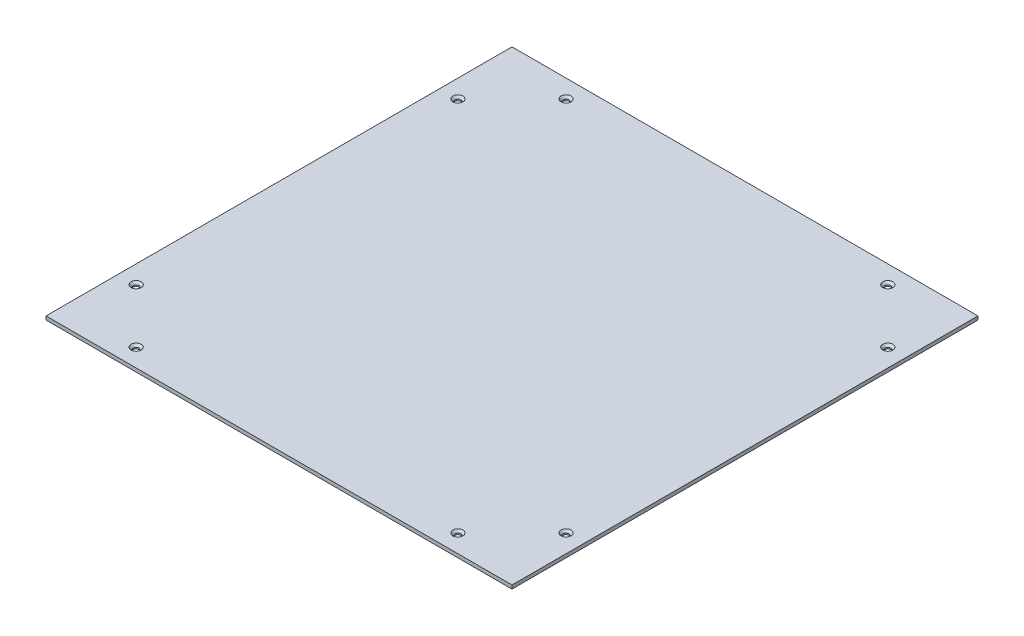
ISO-10303-21;
HEADER;
FILE_DESCRIPTION(('STEP AP214'),'2;1');
FILE_NAME('part.step','',(''),(''),'','','');
FILE_SCHEMA(('AUTOMOTIVE_DESIGN { 1 0 10303 214 1 1 1 1 }'));
ENDSEC;
DATA;
#1=APPLICATION_CONTEXT('core data for automotive mechanical design processes');
#2=APPLICATION_PROTOCOL_DEFINITION('international standard','automotive_design',2000,#1);
#3=PRODUCT_CONTEXT('',#1,'mechanical');
#4=PRODUCT('Part','Part','',(#3));
#5=PRODUCT_RELATED_PRODUCT_CATEGORY('part','',(#4));
#6=PRODUCT_DEFINITION_FORMATION('','',#4);
#7=PRODUCT_DEFINITION_CONTEXT('part definition',#1,'design');
#8=PRODUCT_DEFINITION('design','',#6,#7);
#9=PRODUCT_DEFINITION_SHAPE('','',#8);
#10=(LENGTH_UNIT() NAMED_UNIT(*) SI_UNIT(.MILLI.,.METRE.));
#11=(NAMED_UNIT(*) PLANE_ANGLE_UNIT() SI_UNIT($,.RADIAN.));
#12=(NAMED_UNIT(*) SI_UNIT($,.STERADIAN.) SOLID_ANGLE_UNIT());
#13=UNCERTAINTY_MEASURE_WITH_UNIT(LENGTH_MEASURE(1.E-05),#10,'distance_accuracy_value','');
#14=(GEOMETRIC_REPRESENTATION_CONTEXT(3) GLOBAL_UNCERTAINTY_ASSIGNED_CONTEXT((#13)) GLOBAL_UNIT_ASSIGNED_CONTEXT((#10,
#11,#12)) REPRESENTATION_CONTEXT('',''));
#15=CARTESIAN_POINT('',(0.,0.,0.));
#16=DIRECTION('',(0.,0.,1.));
#17=DIRECTION('',(1.,0.,0.));
#18=AXIS2_PLACEMENT_3D('',#15,#16,#17);
#19=CARTESIAN_POINT('',(323.,5.,-323.));
#20=DIRECTION('',(-1.,0.,0.));
#21=DIRECTION('',(0.,0.,1.));
#22=AXIS2_PLACEMENT_3D('',#19,#20,#21);
#23=PLANE('',#22);
#24=DIRECTION('',(0.,0.,-1.));
#25=VECTOR('',#24,1.);
#26=CARTESIAN_POINT('',(323.,0.,-323.));
#27=LINE('',#26,#25);
#28=CARTESIAN_POINT('',(323.,0.,323.));
#29=VERTEX_POINT('',#28);
#30=CARTESIAN_POINT('',(323.,0.,-323.));
#31=VERTEX_POINT('',#30);
#32=EDGE_CURVE('E100',#29,#31,#27,.T.);
#33=ORIENTED_EDGE('',*,*,#32,.T.);
#34=DIRECTION('',(0.,-1.,0.));
#35=VECTOR('',#34,1.);
#36=CARTESIAN_POINT('',(323.,5.,-323.));
#37=LINE('',#36,#35);
#38=CARTESIAN_POINT('',(323.,5.,-323.));
#39=VERTEX_POINT('',#38);
#40=EDGE_CURVE('E91',#39,#31,#37,.T.);
#41=ORIENTED_EDGE('',*,*,#40,.F.);
#42=DIRECTION('',(0.,0.,-1.));
#43=VECTOR('',#42,1.);
#44=CARTESIAN_POINT('',(323.,5.,-323.));
#45=LINE('',#44,#43);
#46=CARTESIAN_POINT('',(323.,5.,323.));
#47=VERTEX_POINT('',#46);
#48=EDGE_CURVE('E85',#47,#39,#45,.T.);
#49=ORIENTED_EDGE('',*,*,#48,.F.);
#50=DIRECTION('',(0.,-1.,0.));
#51=VECTOR('',#50,1.);
#52=CARTESIAN_POINT('',(323.,5.,323.));
#53=LINE('',#52,#51);
#54=EDGE_CURVE('E96',#47,#29,#53,.T.);
#55=ORIENTED_EDGE('',*,*,#54,.T.);
#56=EDGE_LOOP('',(#33,#41,#49,#55));
#57=FACE_BOUND('',#56,.T.);
#58=ADVANCED_FACE('F32',(#57),#23,.F.);
#59=CARTESIAN_POINT('',(-323.,5.,-323.));
#60=DIRECTION('',(0.,0.,1.));
#61=DIRECTION('',(1.,0.,0.));
#62=AXIS2_PLACEMENT_3D('',#59,#60,#61);
#63=PLANE('',#62);
#64=DIRECTION('',(-1.,0.,0.));
#65=VECTOR('',#64,1.);
#66=CARTESIAN_POINT('',(-323.,0.,-323.));
#67=LINE('',#66,#65);
#68=CARTESIAN_POINT('',(-323.,0.,-323.));
#69=VERTEX_POINT('',#68);
#70=EDGE_CURVE('E90',#31,#69,#67,.T.);
#71=ORIENTED_EDGE('',*,*,#70,.T.);
#72=DIRECTION('',(0.,-1.,0.));
#73=VECTOR('',#72,1.);
#74=CARTESIAN_POINT('',(-323.,5.,-323.));
#75=LINE('',#74,#73);
#76=CARTESIAN_POINT('',(-323.,5.,-323.));
#77=VERTEX_POINT('',#76);
#78=EDGE_CURVE('E88',#77,#69,#75,.T.);
#79=ORIENTED_EDGE('',*,*,#78,.F.);
#80=DIRECTION('',(-1.,0.,0.));
#81=VECTOR('',#80,1.);
#82=CARTESIAN_POINT('',(-323.,5.,-323.));
#83=LINE('',#82,#81);
#84=EDGE_CURVE('E80',#39,#77,#83,.T.);
#85=ORIENTED_EDGE('',*,*,#84,.F.);
#86=ORIENTED_EDGE('',*,*,#40,.T.);
#87=EDGE_LOOP('',(#71,#79,#85,#86));
#88=FACE_BOUND('',#87,.T.);
#89=ADVANCED_FACE('F89',(#88),#63,.F.);
#90=CARTESIAN_POINT('',(-323.,5.,-323.));
#91=DIRECTION('',(1.,0.,0.));
#92=DIRECTION('',(0.,0.,-1.));
#93=AXIS2_PLACEMENT_3D('',#90,#91,#92);
#94=PLANE('',#93);
#95=DIRECTION('',(0.,0.,1.));
#96=VECTOR('',#95,1.);
#97=CARTESIAN_POINT('',(-323.,0.,-323.));
#98=LINE('',#97,#96);
#99=CARTESIAN_POINT('',(-323.,0.,323.));
#100=VERTEX_POINT('',#99);
#101=EDGE_CURVE('E66',#69,#100,#98,.T.);
#102=ORIENTED_EDGE('',*,*,#101,.T.);
#103=DIRECTION('',(0.,-1.,0.));
#104=VECTOR('',#103,1.);
#105=CARTESIAN_POINT('',(-323.,5.,323.));
#106=LINE('',#105,#104);
#107=CARTESIAN_POINT('',(-323.,5.,323.));
#108=VERTEX_POINT('',#107);
#109=EDGE_CURVE('E92',#108,#100,#106,.T.);
#110=ORIENTED_EDGE('',*,*,#109,.F.);
#111=DIRECTION('',(0.,0.,1.));
#112=VECTOR('',#111,1.);
#113=CARTESIAN_POINT('',(-323.,5.,-323.));
#114=LINE('',#113,#112);
#115=EDGE_CURVE('E83',#77,#108,#114,.T.);
#116=ORIENTED_EDGE('',*,*,#115,.F.);
#117=ORIENTED_EDGE('',*,*,#78,.T.);
#118=EDGE_LOOP('',(#102,#110,#116,#117));
#119=FACE_BOUND('',#118,.T.);
#120=ADVANCED_FACE('F94',(#119),#94,.F.);
#121=CARTESIAN_POINT('',(-323.,5.,323.));
#122=DIRECTION('',(0.,0.,-1.));
#123=DIRECTION('',(-1.,0.,0.));
#124=AXIS2_PLACEMENT_3D('',#121,#122,#123);
#125=PLANE('',#124);
#126=DIRECTION('',(1.,0.,0.));
#127=VECTOR('',#126,1.);
#128=CARTESIAN_POINT('',(-323.,0.,323.));
#129=LINE('',#128,#127);
#130=EDGE_CURVE('E72',#100,#29,#129,.T.);
#131=ORIENTED_EDGE('',*,*,#130,.T.);
#132=ORIENTED_EDGE('',*,*,#54,.F.);
#133=DIRECTION('',(1.,0.,0.));
#134=VECTOR('',#133,1.);
#135=CARTESIAN_POINT('',(-323.,5.,323.));
#136=LINE('',#135,#134);
#137=EDGE_CURVE('E49',#108,#47,#136,.T.);
#138=ORIENTED_EDGE('',*,*,#137,.F.);
#139=ORIENTED_EDGE('',*,*,#109,.T.);
#140=EDGE_LOOP('',(#131,#132,#138,#139));
#141=FACE_BOUND('',#140,.T.);
#142=ADVANCED_FACE('F246',(#141),#125,.F.);
#143=CARTESIAN_POINT('',(0.,5.,0.));
#144=DIRECTION('',(0.,1.,0.));
#145=DIRECTION('',(0.,0.,1.));
#146=AXIS2_PLACEMENT_3D('',#143,#144,#145);
#147=PLANE('',#146);
#148=CARTESIAN_POINT('',(-298.,5.,-223.));
#149=DIRECTION('',(0.,1.,0.));
#150=DIRECTION('',(0.,0.,1.));
#151=AXIS2_PLACEMENT_3D('',#148,#149,#150);
#152=CIRCLE('',#151,7.00000000000001);
#153=CARTESIAN_POINT('',(-298.,5.,-216.));
#154=VERTEX_POINT('',#153);
#155=EDGE_CURVE('E134',#154,#154,#152,.F.);
#156=ORIENTED_EDGE('',*,*,#155,.T.);
#157=EDGE_LOOP('',(#156));
#158=FACE_BOUND('',#157,.T.);
#159=CARTESIAN_POINT('',(-223.,5.,-298.));
#160=DIRECTION('',(0.,1.,0.));
#161=DIRECTION('',(0.,0.,1.));
#162=AXIS2_PLACEMENT_3D('',#159,#160,#161);
#163=CIRCLE('',#162,7.00000000000001);
#164=CARTESIAN_POINT('',(-223.,5.,-291.));
#165=VERTEX_POINT('',#164);
#166=EDGE_CURVE('E131',#165,#165,#163,.F.);
#167=ORIENTED_EDGE('',*,*,#166,.T.);
#168=EDGE_LOOP('',(#167));
#169=FACE_BOUND('',#168,.T.);
#170=CARTESIAN_POINT('',(223.,5.,-298.));
#171=DIRECTION('',(0.,1.,0.));
#172=DIRECTION('',(0.,0.,1.));
#173=AXIS2_PLACEMENT_3D('',#170,#171,#172);
#174=CIRCLE('',#173,7.00000000000001);
#175=CARTESIAN_POINT('',(223.,5.,-291.));
#176=VERTEX_POINT('',#175);
#177=EDGE_CURVE('E128',#176,#176,#174,.F.);
#178=ORIENTED_EDGE('',*,*,#177,.T.);
#179=EDGE_LOOP('',(#178));
#180=FACE_BOUND('',#179,.T.);
#181=CARTESIAN_POINT('',(298.,5.,-223.));
#182=DIRECTION('',(0.,1.,0.));
#183=DIRECTION('',(0.,0.,1.));
#184=AXIS2_PLACEMENT_3D('',#181,#182,#183);
#185=CIRCLE('',#184,7.00000000000001);
#186=CARTESIAN_POINT('',(298.,5.,-216.));
#187=VERTEX_POINT('',#186);
#188=EDGE_CURVE('E125',#187,#187,#185,.F.);
#189=ORIENTED_EDGE('',*,*,#188,.T.);
#190=EDGE_LOOP('',(#189));
#191=FACE_BOUND('',#190,.T.);
#192=CARTESIAN_POINT('',(298.,5.,223.));
#193=DIRECTION('',(0.,1.,0.));
#194=DIRECTION('',(0.,0.,1.));
#195=AXIS2_PLACEMENT_3D('',#192,#193,#194);
#196=CIRCLE('',#195,7.00000000000001);
#197=CARTESIAN_POINT('',(298.,5.,230.));
#198=VERTEX_POINT('',#197);
#199=EDGE_CURVE('E122',#198,#198,#196,.F.);
#200=ORIENTED_EDGE('',*,*,#199,.T.);
#201=EDGE_LOOP('',(#200));
#202=FACE_BOUND('',#201,.T.);
#203=CARTESIAN_POINT('',(223.,5.,298.));
#204=DIRECTION('',(0.,1.,0.));
#205=DIRECTION('',(0.,0.,1.));
#206=AXIS2_PLACEMENT_3D('',#203,#204,#205);
#207=CIRCLE('',#206,7.00000000000001);
#208=CARTESIAN_POINT('',(223.,5.,305.));
#209=VERTEX_POINT('',#208);
#210=EDGE_CURVE('E119',#209,#209,#207,.F.);
#211=ORIENTED_EDGE('',*,*,#210,.T.);
#212=EDGE_LOOP('',(#211));
#213=FACE_BOUND('',#212,.T.);
#214=CARTESIAN_POINT('',(-223.,5.,298.));
#215=DIRECTION('',(0.,1.,0.));
#216=DIRECTION('',(0.,0.,1.));
#217=AXIS2_PLACEMENT_3D('',#214,#215,#216);
#218=CIRCLE('',#217,7.00000000000001);
#219=CARTESIAN_POINT('',(-223.,5.,305.));
#220=VERTEX_POINT('',#219);
#221=EDGE_CURVE('E116',#220,#220,#218,.F.);
#222=ORIENTED_EDGE('',*,*,#221,.T.);
#223=EDGE_LOOP('',(#222));
#224=FACE_BOUND('',#223,.T.);
#225=CARTESIAN_POINT('',(-298.,5.,223.));
#226=DIRECTION('',(0.,1.,0.));
#227=DIRECTION('',(0.,0.,1.));
#228=AXIS2_PLACEMENT_3D('',#225,#226,#227);
#229=CIRCLE('',#228,7.00000000000001);
#230=CARTESIAN_POINT('',(-298.,5.,230.));
#231=VERTEX_POINT('',#230);
#232=EDGE_CURVE('E113',#231,#231,#229,.F.);
#233=ORIENTED_EDGE('',*,*,#232,.T.);
#234=EDGE_LOOP('',(#233));
#235=FACE_BOUND('',#234,.T.);
#236=ORIENTED_EDGE('',*,*,#48,.T.);
#237=ORIENTED_EDGE('',*,*,#84,.T.);
#238=ORIENTED_EDGE('',*,*,#115,.T.);
#239=ORIENTED_EDGE('',*,*,#137,.T.);
#240=EDGE_LOOP('',(#236,#237,#238,#239));
#241=FACE_BOUND('',#240,.T.);
#242=ADVANCED_FACE('F81',(#158,#169,#180,#191,#202,#213,#224,#235,#241),#147,.T.);
#243=CARTESIAN_POINT('',(0.,0.,0.));
#244=DIRECTION('',(0.,1.,0.));
#245=DIRECTION('',(0.,0.,1.));
#246=AXIS2_PLACEMENT_3D('',#243,#244,#245);
#247=PLANE('',#246);
#248=CARTESIAN_POINT('',(-298.,0.,-223.));
#249=DIRECTION('',(0.,1.,0.));
#250=DIRECTION('',(0.,0.,-1.));
#251=AXIS2_PLACEMENT_3D('',#248,#249,#250);
#252=CIRCLE('',#251,3.99999999999999);
#253=CARTESIAN_POINT('',(-298.,0.,-227.));
#254=VERTEX_POINT('',#253);
#255=EDGE_CURVE('E383',#254,#254,#252,.T.);
#256=ORIENTED_EDGE('',*,*,#255,.T.);
#257=EDGE_LOOP('',(#256));
#258=FACE_BOUND('',#257,.T.);
#259=CARTESIAN_POINT('',(-223.,0.,-298.));
#260=DIRECTION('',(0.,1.,0.));
#261=DIRECTION('',(0.,0.,-1.));
#262=AXIS2_PLACEMENT_3D('',#259,#260,#261);
#263=CIRCLE('',#262,3.99999999999999);
#264=CARTESIAN_POINT('',(-223.,0.,-302.));
#265=VERTEX_POINT('',#264);
#266=EDGE_CURVE('E384',#265,#265,#263,.T.);
#267=ORIENTED_EDGE('',*,*,#266,.T.);
#268=EDGE_LOOP('',(#267));
#269=FACE_BOUND('',#268,.T.);
#270=CARTESIAN_POINT('',(223.,0.,-298.));
#271=DIRECTION('',(0.,1.,0.));
#272=DIRECTION('',(0.,0.,1.));
#273=AXIS2_PLACEMENT_3D('',#270,#271,#272);
#274=CIRCLE('',#273,3.99999999999999);
#275=CARTESIAN_POINT('',(223.,0.,-294.));
#276=VERTEX_POINT('',#275);
#277=EDGE_CURVE('E221',#276,#276,#274,.T.);
#278=ORIENTED_EDGE('',*,*,#277,.T.);
#279=EDGE_LOOP('',(#278));
#280=FACE_BOUND('',#279,.T.);
#281=CARTESIAN_POINT('',(298.,0.,-223.));
#282=DIRECTION('',(0.,1.,0.));
#283=DIRECTION('',(0.,0.,1.));
#284=AXIS2_PLACEMENT_3D('',#281,#282,#283);
#285=CIRCLE('',#284,3.99999999999999);
#286=CARTESIAN_POINT('',(298.,0.,-219.));
#287=VERTEX_POINT('',#286);
#288=EDGE_CURVE('E215',#287,#287,#285,.T.);
#289=ORIENTED_EDGE('',*,*,#288,.T.);
#290=EDGE_LOOP('',(#289));
#291=FACE_BOUND('',#290,.T.);
#292=CARTESIAN_POINT('',(298.,0.,223.));
#293=DIRECTION('',(0.,1.,0.));
#294=DIRECTION('',(0.,0.,-1.));
#295=AXIS2_PLACEMENT_3D('',#292,#293,#294);
#296=CIRCLE('',#295,3.99999999999999);
#297=CARTESIAN_POINT('',(298.,0.,219.));
#298=VERTEX_POINT('',#297);
#299=EDGE_CURVE('E212',#298,#298,#296,.T.);
#300=ORIENTED_EDGE('',*,*,#299,.T.);
#301=EDGE_LOOP('',(#300));
#302=FACE_BOUND('',#301,.T.);
#303=CARTESIAN_POINT('',(-298.,0.,223.));
#304=DIRECTION('',(0.,1.,0.));
#305=DIRECTION('',(0.,0.,1.));
#306=AXIS2_PLACEMENT_3D('',#303,#304,#305);
#307=CIRCLE('',#306,3.99999999999999);
#308=CARTESIAN_POINT('',(-298.,0.,227.));
#309=VERTEX_POINT('',#308);
#310=EDGE_CURVE('E214',#309,#309,#307,.T.);
#311=ORIENTED_EDGE('',*,*,#310,.T.);
#312=EDGE_LOOP('',(#311));
#313=FACE_BOUND('',#312,.T.);
#314=CARTESIAN_POINT('',(223.,0.,298.));
#315=DIRECTION('',(0.,1.,0.));
#316=DIRECTION('',(0.,0.,-1.));
#317=AXIS2_PLACEMENT_3D('',#314,#315,#316);
#318=CIRCLE('',#317,3.99999999999999);
#319=CARTESIAN_POINT('',(223.,0.,294.));
#320=VERTEX_POINT('',#319);
#321=EDGE_CURVE('E218',#320,#320,#318,.T.);
#322=ORIENTED_EDGE('',*,*,#321,.T.);
#323=EDGE_LOOP('',(#322));
#324=FACE_BOUND('',#323,.T.);
#325=CARTESIAN_POINT('',(-223.,0.,298.));
#326=DIRECTION('',(0.,1.,0.));
#327=DIRECTION('',(0.,0.,1.));
#328=AXIS2_PLACEMENT_3D('',#325,#326,#327);
#329=CIRCLE('',#328,3.99999999999999);
#330=CARTESIAN_POINT('',(-223.,0.,302.));
#331=VERTEX_POINT('',#330);
#332=EDGE_CURVE('E103',#331,#331,#329,.T.);
#333=ORIENTED_EDGE('',*,*,#332,.T.);
#334=EDGE_LOOP('',(#333));
#335=FACE_BOUND('',#334,.T.);
#336=ORIENTED_EDGE('',*,*,#32,.F.);
#337=ORIENTED_EDGE('',*,*,#130,.F.);
#338=ORIENTED_EDGE('',*,*,#101,.F.);
#339=ORIENTED_EDGE('',*,*,#70,.F.);
#340=EDGE_LOOP('',(#336,#337,#338,#339));
#341=FACE_BOUND('',#340,.T.);
#342=ADVANCED_FACE('F230',(#258,#269,#280,#291,#302,#313,#324,#335,#341),#247,.F.);
#343=CARTESIAN_POINT('',(-223.,0.,298.));
#344=DIRECTION('',(0.,1.,0.));
#345=DIRECTION('',(0.,0.,1.));
#346=AXIS2_PLACEMENT_3D('',#343,#344,#345);
#347=CYLINDRICAL_SURFACE('',#346,3.99999999999999);
#348=CARTESIAN_POINT('',(-223.,2.00000000000008,298.));
#349=DIRECTION('',(0.,1.,0.));
#350=DIRECTION('',(0.,0.,1.));
#351=AXIS2_PLACEMENT_3D('',#348,#349,#350);
#352=CIRCLE('',#351,3.99999999999999);
#353=CARTESIAN_POINT('',(-223.,2.00000000000008,302.));
#354=VERTEX_POINT('',#353);
#355=EDGE_CURVE('E41',#354,#354,#352,.T.);
#356=ORIENTED_EDGE('',*,*,#355,.T.);
#357=EDGE_LOOP('',(#356));
#358=FACE_BOUND('',#357,.T.);
#359=ORIENTED_EDGE('',*,*,#332,.F.);
#360=EDGE_LOOP('',(#359));
#361=FACE_BOUND('',#360,.T.);
#362=ADVANCED_FACE('F154',(#358,#361),#347,.F.);
#363=CARTESIAN_POINT('',(223.,0.,298.));
#364=DIRECTION('',(0.,1.,0.));
#365=DIRECTION('',(0.,0.,1.));
#366=AXIS2_PLACEMENT_3D('',#363,#364,#365);
#367=CYLINDRICAL_SURFACE('',#366,3.99999999999999);
#368=CARTESIAN_POINT('',(223.,2.00000000000008,298.));
#369=DIRECTION('',(0.,1.,0.));
#370=DIRECTION('',(0.,0.,1.));
#371=AXIS2_PLACEMENT_3D('',#368,#369,#370);
#372=CIRCLE('',#371,3.99999999999999);
#373=CARTESIAN_POINT('',(223.,2.00000000000008,302.));
#374=VERTEX_POINT('',#373);
#375=EDGE_CURVE('E149',#374,#374,#372,.T.);
#376=ORIENTED_EDGE('',*,*,#375,.T.);
#377=EDGE_LOOP('',(#376));
#378=FACE_BOUND('',#377,.T.);
#379=ORIENTED_EDGE('',*,*,#321,.F.);
#380=EDGE_LOOP('',(#379));
#381=FACE_BOUND('',#380,.T.);
#382=ADVANCED_FACE('F233',(#378,#381),#367,.F.);
#383=CARTESIAN_POINT('',(-298.,0.,223.));
#384=DIRECTION('',(0.,1.,0.));
#385=DIRECTION('',(0.,0.,1.));
#386=AXIS2_PLACEMENT_3D('',#383,#384,#385);
#387=CYLINDRICAL_SURFACE('',#386,3.99999999999999);
#388=CARTESIAN_POINT('',(-298.,2.00000000000008,223.));
#389=DIRECTION('',(0.,1.,0.));
#390=DIRECTION('',(0.,0.,1.));
#391=AXIS2_PLACEMENT_3D('',#388,#389,#390);
#392=CIRCLE('',#391,3.99999999999999);
#393=CARTESIAN_POINT('',(-298.,2.00000000000008,227.));
#394=VERTEX_POINT('',#393);
#395=EDGE_CURVE('E11',#394,#394,#392,.T.);
#396=ORIENTED_EDGE('',*,*,#395,.T.);
#397=EDGE_LOOP('',(#396));
#398=FACE_BOUND('',#397,.T.);
#399=ORIENTED_EDGE('',*,*,#310,.F.);
#400=EDGE_LOOP('',(#399));
#401=FACE_BOUND('',#400,.T.);
#402=ADVANCED_FACE('F208',(#398,#401),#387,.F.);
#403=CARTESIAN_POINT('',(298.,0.,223.));
#404=DIRECTION('',(0.,1.,0.));
#405=DIRECTION('',(0.,0.,1.));
#406=AXIS2_PLACEMENT_3D('',#403,#404,#405);
#407=CYLINDRICAL_SURFACE('',#406,3.99999999999999);
#408=CARTESIAN_POINT('',(298.,2.00000000000008,223.));
#409=DIRECTION('',(0.,1.,0.));
#410=DIRECTION('',(0.,0.,1.));
#411=AXIS2_PLACEMENT_3D('',#408,#409,#410);
#412=CIRCLE('',#411,3.99999999999999);
#413=CARTESIAN_POINT('',(298.,2.00000000000008,227.));
#414=VERTEX_POINT('',#413);
#415=EDGE_CURVE('E146',#414,#414,#412,.T.);
#416=ORIENTED_EDGE('',*,*,#415,.T.);
#417=EDGE_LOOP('',(#416));
#418=FACE_BOUND('',#417,.T.);
#419=ORIENTED_EDGE('',*,*,#299,.F.);
#420=EDGE_LOOP('',(#419));
#421=FACE_BOUND('',#420,.T.);
#422=ADVANCED_FACE('F204',(#418,#421),#407,.F.);
#423=CARTESIAN_POINT('',(298.,0.,-223.));
#424=DIRECTION('',(0.,1.,0.));
#425=DIRECTION('',(0.,0.,1.));
#426=AXIS2_PLACEMENT_3D('',#423,#424,#425);
#427=CYLINDRICAL_SURFACE('',#426,3.99999999999999);
#428=CARTESIAN_POINT('',(298.,2.00000000000008,-223.));
#429=DIRECTION('',(0.,1.,0.));
#430=DIRECTION('',(0.,0.,1.));
#431=AXIS2_PLACEMENT_3D('',#428,#429,#430);
#432=CIRCLE('',#431,3.99999999999999);
#433=CARTESIAN_POINT('',(298.,2.00000000000008,-219.));
#434=VERTEX_POINT('',#433);
#435=EDGE_CURVE('E143',#434,#434,#432,.T.);
#436=ORIENTED_EDGE('',*,*,#435,.T.);
#437=EDGE_LOOP('',(#436));
#438=FACE_BOUND('',#437,.T.);
#439=ORIENTED_EDGE('',*,*,#288,.F.);
#440=EDGE_LOOP('',(#439));
#441=FACE_BOUND('',#440,.T.);
#442=ADVANCED_FACE('F207',(#438,#441),#427,.F.);
#443=CARTESIAN_POINT('',(223.,0.,-298.));
#444=DIRECTION('',(0.,1.,0.));
#445=DIRECTION('',(0.,0.,1.));
#446=AXIS2_PLACEMENT_3D('',#443,#444,#445);
#447=CYLINDRICAL_SURFACE('',#446,3.99999999999999);
#448=CARTESIAN_POINT('',(223.,2.00000000000008,-298.));
#449=DIRECTION('',(0.,1.,0.));
#450=DIRECTION('',(0.,0.,1.));
#451=AXIS2_PLACEMENT_3D('',#448,#449,#450);
#452=CIRCLE('',#451,3.99999999999999);
#453=CARTESIAN_POINT('',(223.,2.00000000000008,-294.));
#454=VERTEX_POINT('',#453);
#455=EDGE_CURVE('E140',#454,#454,#452,.T.);
#456=ORIENTED_EDGE('',*,*,#455,.T.);
#457=EDGE_LOOP('',(#456));
#458=FACE_BOUND('',#457,.T.);
#459=ORIENTED_EDGE('',*,*,#277,.F.);
#460=EDGE_LOOP('',(#459));
#461=FACE_BOUND('',#460,.T.);
#462=ADVANCED_FACE('F300',(#458,#461),#447,.F.);
#463=CARTESIAN_POINT('',(-223.,0.,-298.));
#464=DIRECTION('',(0.,1.,0.));
#465=DIRECTION('',(0.,0.,1.));
#466=AXIS2_PLACEMENT_3D('',#463,#464,#465);
#467=CYLINDRICAL_SURFACE('',#466,3.99999999999999);
#468=CARTESIAN_POINT('',(-223.,2.00000000000008,-298.));
#469=DIRECTION('',(0.,1.,0.));
#470=DIRECTION('',(0.,0.,1.));
#471=AXIS2_PLACEMENT_3D('',#468,#469,#470);
#472=CIRCLE('',#471,3.99999999999999);
#473=CARTESIAN_POINT('',(-223.,2.00000000000008,-294.));
#474=VERTEX_POINT('',#473);
#475=EDGE_CURVE('E137',#474,#474,#472,.T.);
#476=ORIENTED_EDGE('',*,*,#475,.T.);
#477=EDGE_LOOP('',(#476));
#478=FACE_BOUND('',#477,.T.);
#479=ORIENTED_EDGE('',*,*,#266,.F.);
#480=EDGE_LOOP('',(#479));
#481=FACE_BOUND('',#480,.T.);
#482=ADVANCED_FACE('F309',(#478,#481),#467,.F.);
#483=CARTESIAN_POINT('',(-298.,0.,-223.));
#484=DIRECTION('',(0.,1.,0.));
#485=DIRECTION('',(0.,0.,1.));
#486=AXIS2_PLACEMENT_3D('',#483,#484,#485);
#487=CYLINDRICAL_SURFACE('',#486,3.99999999999999);
#488=CARTESIAN_POINT('',(-298.,2.00000000000008,-223.));
#489=DIRECTION('',(0.,1.,0.));
#490=DIRECTION('',(0.,0.,1.));
#491=AXIS2_PLACEMENT_3D('',#488,#489,#490);
#492=CIRCLE('',#491,3.99999999999999);
#493=CARTESIAN_POINT('',(-298.,2.00000000000008,-219.));
#494=VERTEX_POINT('',#493);
#495=EDGE_CURVE('E110',#494,#494,#492,.T.);
#496=ORIENTED_EDGE('',*,*,#495,.T.);
#497=EDGE_LOOP('',(#496));
#498=FACE_BOUND('',#497,.T.);
#499=ORIENTED_EDGE('',*,*,#255,.F.);
#500=EDGE_LOOP('',(#499));
#501=FACE_BOUND('',#500,.T.);
#502=ADVANCED_FACE('F183',(#498,#501),#487,.F.);
#503=CARTESIAN_POINT('',(-298.,2.00000000000008,-223.));
#504=DIRECTION('',(0.,1.,0.));
#505=DIRECTION('',(0.,0.,1.));
#506=AXIS2_PLACEMENT_3D('',#503,#504,#505);
#507=CONICAL_SURFACE('',#506,3.99999999999999,0.785398163397464);
#508=ORIENTED_EDGE('',*,*,#155,.F.);
#509=EDGE_LOOP('',(#508));
#510=FACE_BOUND('',#509,.T.);
#511=ORIENTED_EDGE('',*,*,#495,.F.);
#512=EDGE_LOOP('',(#511));
#513=FACE_BOUND('',#512,.T.);
#514=ADVANCED_FACE('F179',(#510,#513),#507,.F.);
#515=CARTESIAN_POINT('',(-223.,2.00000000000008,-298.));
#516=DIRECTION('',(0.,1.,0.));
#517=DIRECTION('',(0.,0.,1.));
#518=AXIS2_PLACEMENT_3D('',#515,#516,#517);
#519=CONICAL_SURFACE('',#518,3.99999999999999,0.785398163397464);
#520=ORIENTED_EDGE('',*,*,#166,.F.);
#521=EDGE_LOOP('',(#520));
#522=FACE_BOUND('',#521,.T.);
#523=ORIENTED_EDGE('',*,*,#475,.F.);
#524=EDGE_LOOP('',(#523));
#525=FACE_BOUND('',#524,.T.);
#526=ADVANCED_FACE('F182',(#522,#525),#519,.F.);
#527=CARTESIAN_POINT('',(223.,2.00000000000008,-298.));
#528=DIRECTION('',(0.,1.,0.));
#529=DIRECTION('',(0.,0.,1.));
#530=AXIS2_PLACEMENT_3D('',#527,#528,#529);
#531=CONICAL_SURFACE('',#530,3.99999999999999,0.785398163397464);
#532=ORIENTED_EDGE('',*,*,#177,.F.);
#533=EDGE_LOOP('',(#532));
#534=FACE_BOUND('',#533,.T.);
#535=ORIENTED_EDGE('',*,*,#455,.F.);
#536=EDGE_LOOP('',(#535));
#537=FACE_BOUND('',#536,.T.);
#538=ADVANCED_FACE('F187',(#534,#537),#531,.F.);
#539=CARTESIAN_POINT('',(298.,2.00000000000008,-223.));
#540=DIRECTION('',(0.,1.,0.));
#541=DIRECTION('',(0.,0.,1.));
#542=AXIS2_PLACEMENT_3D('',#539,#540,#541);
#543=CONICAL_SURFACE('',#542,3.99999999999999,0.785398163397464);
#544=ORIENTED_EDGE('',*,*,#188,.F.);
#545=EDGE_LOOP('',(#544));
#546=FACE_BOUND('',#545,.T.);
#547=ORIENTED_EDGE('',*,*,#435,.F.);
#548=EDGE_LOOP('',(#547));
#549=FACE_BOUND('',#548,.T.);
#550=ADVANCED_FACE('F191',(#546,#549),#543,.F.);
#551=CARTESIAN_POINT('',(298.,2.00000000000008,223.));
#552=DIRECTION('',(0.,1.,0.));
#553=DIRECTION('',(0.,0.,1.));
#554=AXIS2_PLACEMENT_3D('',#551,#552,#553);
#555=CONICAL_SURFACE('',#554,3.99999999999999,0.785398163397464);
#556=ORIENTED_EDGE('',*,*,#199,.F.);
#557=EDGE_LOOP('',(#556));
#558=FACE_BOUND('',#557,.T.);
#559=ORIENTED_EDGE('',*,*,#415,.F.);
#560=EDGE_LOOP('',(#559));
#561=FACE_BOUND('',#560,.T.);
#562=ADVANCED_FACE('F166',(#558,#561),#555,.F.);
#563=CARTESIAN_POINT('',(223.,2.00000000000008,298.));
#564=DIRECTION('',(0.,1.,0.));
#565=DIRECTION('',(0.,0.,1.));
#566=AXIS2_PLACEMENT_3D('',#563,#564,#565);
#567=CONICAL_SURFACE('',#566,3.99999999999999,0.785398163397464);
#568=ORIENTED_EDGE('',*,*,#210,.F.);
#569=EDGE_LOOP('',(#568));
#570=FACE_BOUND('',#569,.T.);
#571=ORIENTED_EDGE('',*,*,#375,.F.);
#572=EDGE_LOOP('',(#571));
#573=FACE_BOUND('',#572,.T.);
#574=ADVANCED_FACE('F159',(#570,#573),#567,.F.);
#575=CARTESIAN_POINT('',(-223.,2.00000000000008,298.));
#576=DIRECTION('',(0.,1.,0.));
#577=DIRECTION('',(0.,0.,1.));
#578=AXIS2_PLACEMENT_3D('',#575,#576,#577);
#579=CONICAL_SURFACE('',#578,3.99999999999999,0.785398163397464);
#580=ORIENTED_EDGE('',*,*,#221,.F.);
#581=EDGE_LOOP('',(#580));
#582=FACE_BOUND('',#581,.T.);
#583=ORIENTED_EDGE('',*,*,#355,.F.);
#584=EDGE_LOOP('',(#583));
#585=FACE_BOUND('',#584,.T.);
#586=ADVANCED_FACE('F157',(#582,#585),#579,.F.);
#587=CARTESIAN_POINT('',(-298.,2.00000000000008,223.));
#588=DIRECTION('',(0.,1.,0.));
#589=DIRECTION('',(0.,0.,1.));
#590=AXIS2_PLACEMENT_3D('',#587,#588,#589);
#591=CONICAL_SURFACE('',#590,3.99999999999999,0.785398163397464);
#592=ORIENTED_EDGE('',*,*,#232,.F.);
#593=EDGE_LOOP('',(#592));
#594=FACE_BOUND('',#593,.T.);
#595=ORIENTED_EDGE('',*,*,#395,.F.);
#596=EDGE_LOOP('',(#595));
#597=FACE_BOUND('',#596,.T.);
#598=ADVANCED_FACE('F34',(#594,#597),#591,.F.);
#599=CLOSED_SHELL('',(#58,#89,#120,#142,#242,#342,#362,#382,#402,#422,#442,#462,#482,#502,#514,
#526,#538,#550,#562,#574,#586,#598));
#600=MANIFOLD_SOLID_BREP('B2',#599);
#601=ADVANCED_BREP_SHAPE_REPRESENTATION('',(#18,#600),#14);
#602=SHAPE_DEFINITION_REPRESENTATION(#9,#601);
ENDSEC;
END-ISO-10303-21;
